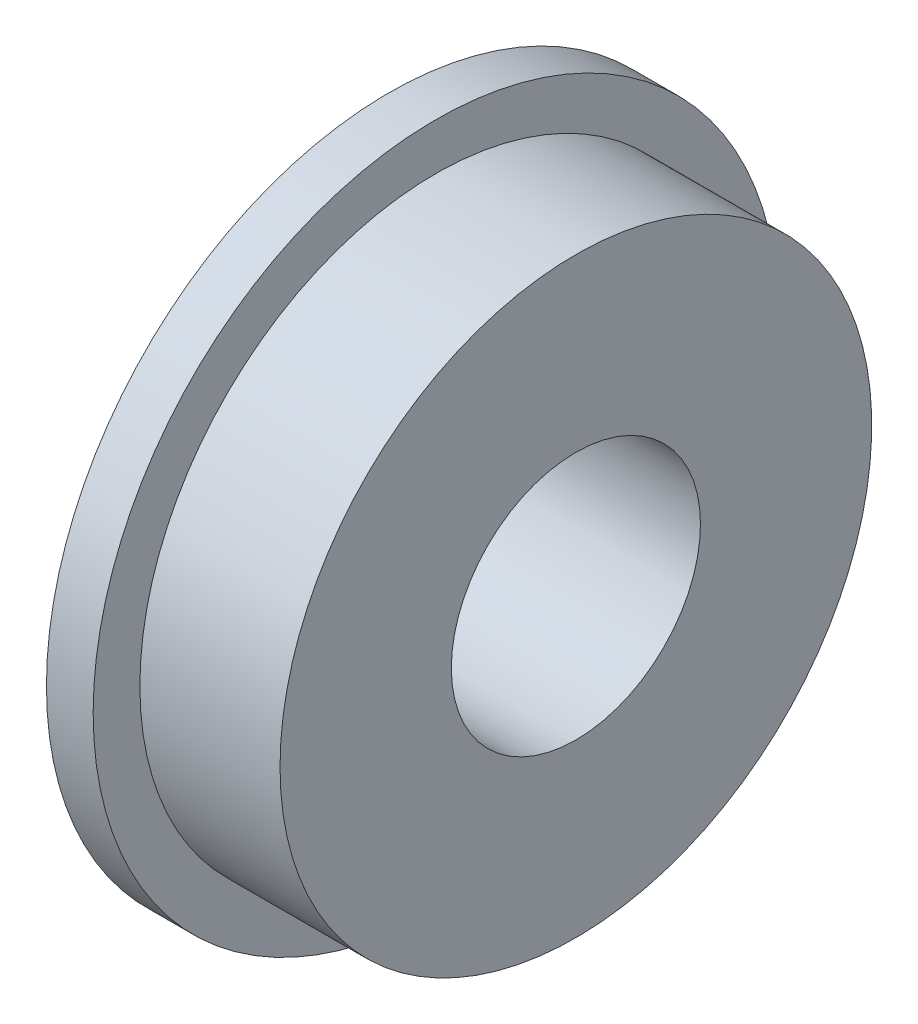
ISO-10303-21;
HEADER;
FILE_DESCRIPTION(('STEP AP214'),'2;1');
FILE_NAME('part.step','',(''),(''),'','','');
FILE_SCHEMA(('AUTOMOTIVE_DESIGN { 1 0 10303 214 1 1 1 1 }'));
ENDSEC;
DATA;
#1=APPLICATION_CONTEXT('core data for automotive mechanical design processes');
#2=APPLICATION_PROTOCOL_DEFINITION('international standard','automotive_design',2000,#1);
#3=PRODUCT_CONTEXT('',#1,'mechanical');
#4=PRODUCT('Part','Part','',(#3));
#5=PRODUCT_RELATED_PRODUCT_CATEGORY('part','',(#4));
#6=PRODUCT_DEFINITION_FORMATION('','',#4);
#7=PRODUCT_DEFINITION_CONTEXT('part definition',#1,'design');
#8=PRODUCT_DEFINITION('design','',#6,#7);
#9=PRODUCT_DEFINITION_SHAPE('','',#8);
#10=(LENGTH_UNIT() NAMED_UNIT(*) SI_UNIT(.MILLI.,.METRE.));
#11=(NAMED_UNIT(*) PLANE_ANGLE_UNIT() SI_UNIT($,.RADIAN.));
#12=(NAMED_UNIT(*) SI_UNIT($,.STERADIAN.) SOLID_ANGLE_UNIT());
#13=UNCERTAINTY_MEASURE_WITH_UNIT(LENGTH_MEASURE(1.E-05),#10,'distance_accuracy_value','');
#14=(GEOMETRIC_REPRESENTATION_CONTEXT(3) GLOBAL_UNCERTAINTY_ASSIGNED_CONTEXT((#13)) GLOBAL_UNIT_ASSIGNED_CONTEXT((#10,
#11,#12)) REPRESENTATION_CONTEXT('',''));
#15=CARTESIAN_POINT('',(0.,0.,0.));
#16=DIRECTION('',(0.,0.,1.));
#17=DIRECTION('',(1.,0.,0.));
#18=AXIS2_PLACEMENT_3D('',#15,#16,#17);
#19=CARTESIAN_POINT('',(6.3000000000002,3.1028875949998E-13,0.));
#20=DIRECTION('',(-1.,0.,0.));
#21=DIRECTION('',(0.,0.,1.));
#22=AXIS2_PLACEMENT_3D('',#19,#20,#21);
#23=CYLINDRICAL_SURFACE('',#22,9.5000000000001);
#24=CARTESIAN_POINT('',(1.5000000000001,3.1028875949998E-13,0.));
#25=DIRECTION('',(-1.,0.,0.));
#26=DIRECTION('',(0.,0.,1.));
#27=AXIS2_PLACEMENT_3D('',#24,#25,#26);
#28=CIRCLE('',#27,9.5000000000001);
#29=CARTESIAN_POINT('',(1.5000000000001,3.1028875949998E-13,9.5000000000001));
#30=VERTEX_POINT('',#29);
#31=EDGE_CURVE('E20',#30,#30,#28,.F.);
#32=ORIENTED_EDGE('',*,*,#31,.T.);
#33=EDGE_LOOP('',(#32));
#34=FACE_BOUND('',#33,.T.);
#35=CARTESIAN_POINT('',(5.99999999999886,3.1028875949998E-13,0.));
#36=DIRECTION('',(-1.,0.,0.));
#37=DIRECTION('',(0.,0.,1.));
#38=AXIS2_PLACEMENT_3D('',#35,#36,#37);
#39=CIRCLE('',#38,9.5000000000001);
#40=CARTESIAN_POINT('',(5.99999999999886,3.1028875949998E-13,9.5000000000001));
#41=VERTEX_POINT('',#40);
#42=EDGE_CURVE('E39',#41,#41,#39,.T.);
#43=ORIENTED_EDGE('',*,*,#42,.T.);
#44=EDGE_LOOP('',(#43));
#45=FACE_BOUND('',#44,.T.);
#46=ADVANCED_FACE('F17',(#34,#45),#23,.T.);
#47=CARTESIAN_POINT('',(1.5000000000001,3.10876589963636E-13,0.));
#48=DIRECTION('',(-1.,0.,0.));
#49=DIRECTION('',(0.,0.,1.));
#50=AXIS2_PLACEMENT_3D('',#47,#48,#49);
#51=PLANE('',#50);
#52=ORIENTED_EDGE('',*,*,#31,.F.);
#53=EDGE_LOOP('',(#52));
#54=FACE_BOUND('',#53,.T.);
#55=CARTESIAN_POINT('',(1.5000000000001,3.1028875949998E-13,0.));
#56=DIRECTION('',(-1.,0.,0.));
#57=DIRECTION('',(0.,0.,1.));
#58=AXIS2_PLACEMENT_3D('',#55,#56,#57);
#59=CIRCLE('',#58,10.9999999999992);
#60=CARTESIAN_POINT('',(1.5000000000001,3.1028875949998E-13,10.9999999999992));
#61=VERTEX_POINT('',#60);
#62=EDGE_CURVE('E35',#61,#61,#59,.T.);
#63=ORIENTED_EDGE('',*,*,#62,.F.);
#64=EDGE_LOOP('',(#63));
#65=FACE_BOUND('',#64,.T.);
#66=ADVANCED_FACE('F49',(#54,#65),#51,.F.);
#67=CARTESIAN_POINT('',(5.99999999999886,3.10325498904022E-13,0.));
#68=DIRECTION('',(-1.,0.,0.));
#69=DIRECTION('',(0.,0.,1.));
#70=AXIS2_PLACEMENT_3D('',#67,#68,#69);
#71=PLANE('',#70);
#72=CARTESIAN_POINT('',(5.99999999999886,3.1028875949998E-13,0.));
#73=DIRECTION('',(-1.,0.,0.));
#74=DIRECTION('',(0.,0.,1.));
#75=AXIS2_PLACEMENT_3D('',#72,#73,#74);
#76=CIRCLE('',#75,3.99999999999924);
#77=CARTESIAN_POINT('',(5.99999999999886,3.1028875949998E-13,3.99999999999924));
#78=VERTEX_POINT('',#77);
#79=EDGE_CURVE('E29',#78,#78,#76,.T.);
#80=ORIENTED_EDGE('',*,*,#79,.T.);
#81=EDGE_LOOP('',(#80));
#82=FACE_BOUND('',#81,.T.);
#83=ORIENTED_EDGE('',*,*,#42,.F.);
#84=EDGE_LOOP('',(#83));
#85=FACE_BOUND('',#84,.T.);
#86=ADVANCED_FACE('F52',(#82,#85),#71,.F.);
#87=CARTESIAN_POINT('',(6.3000000000002,3.1028875949998E-13,0.));
#88=DIRECTION('',(-1.,0.,0.));
#89=DIRECTION('',(0.,0.,1.));
#90=AXIS2_PLACEMENT_3D('',#87,#88,#89);
#91=CYLINDRICAL_SURFACE('',#90,10.9999999999992);
#92=CARTESIAN_POINT('',(0.,3.1028875949998E-13,0.));
#93=DIRECTION('',(-1.,0.,0.));
#94=DIRECTION('',(0.,0.,1.));
#95=AXIS2_PLACEMENT_3D('',#92,#93,#94);
#96=CIRCLE('',#95,10.9999999999992);
#97=CARTESIAN_POINT('',(0.,3.1028875949998E-13,10.9999999999992));
#98=VERTEX_POINT('',#97);
#99=EDGE_CURVE('E24',#98,#98,#96,.T.);
#100=ORIENTED_EDGE('',*,*,#99,.F.);
#101=EDGE_LOOP('',(#100));
#102=FACE_BOUND('',#101,.T.);
#103=ORIENTED_EDGE('',*,*,#62,.T.);
#104=EDGE_LOOP('',(#103));
#105=FACE_BOUND('',#104,.T.);
#106=ADVANCED_FACE('F55',(#102,#105),#91,.T.);
#107=CARTESIAN_POINT('',(6.3000000000002,3.1028875949998E-13,0.));
#108=DIRECTION('',(-1.,0.,0.));
#109=DIRECTION('',(0.,0.,1.));
#110=AXIS2_PLACEMENT_3D('',#107,#108,#109);
#111=CYLINDRICAL_SURFACE('',#110,3.99999999999924);
#112=CARTESIAN_POINT('',(0.,3.1028875949998E-13,0.));
#113=DIRECTION('',(-1.,0.,0.));
#114=DIRECTION('',(0.,0.,1.));
#115=AXIS2_PLACEMENT_3D('',#112,#113,#114);
#116=CIRCLE('',#115,3.99999999999924);
#117=CARTESIAN_POINT('',(0.,3.1028875949998E-13,3.99999999999924));
#118=VERTEX_POINT('',#117);
#119=EDGE_CURVE('E11',#118,#118,#116,.F.);
#120=ORIENTED_EDGE('',*,*,#119,.F.);
#121=EDGE_LOOP('',(#120));
#122=FACE_BOUND('',#121,.T.);
#123=ORIENTED_EDGE('',*,*,#79,.F.);
#124=EDGE_LOOP('',(#123));
#125=FACE_BOUND('',#124,.T.);
#126=ADVANCED_FACE('F57',(#122,#125),#111,.F.);
#127=CARTESIAN_POINT('',(0.,3.11060286983338E-13,0.));
#128=DIRECTION('',(-1.,0.,0.));
#129=DIRECTION('',(0.,0.,1.));
#130=AXIS2_PLACEMENT_3D('',#127,#128,#129);
#131=PLANE('',#130);
#132=ORIENTED_EDGE('',*,*,#119,.T.);
#133=EDGE_LOOP('',(#132));
#134=FACE_BOUND('',#133,.T.);
#135=ORIENTED_EDGE('',*,*,#99,.T.);
#136=EDGE_LOOP('',(#135));
#137=FACE_BOUND('',#136,.T.);
#138=ADVANCED_FACE('F65',(#134,#137),#131,.T.);
#139=CLOSED_SHELL('',(#46,#66,#86,#106,#126,#138));
#140=MANIFOLD_SOLID_BREP('B1',#139);
#141=ADVANCED_BREP_SHAPE_REPRESENTATION('',(#18,#140),#14);
#142=SHAPE_DEFINITION_REPRESENTATION(#9,#141);
ENDSEC;
END-ISO-10303-21;
